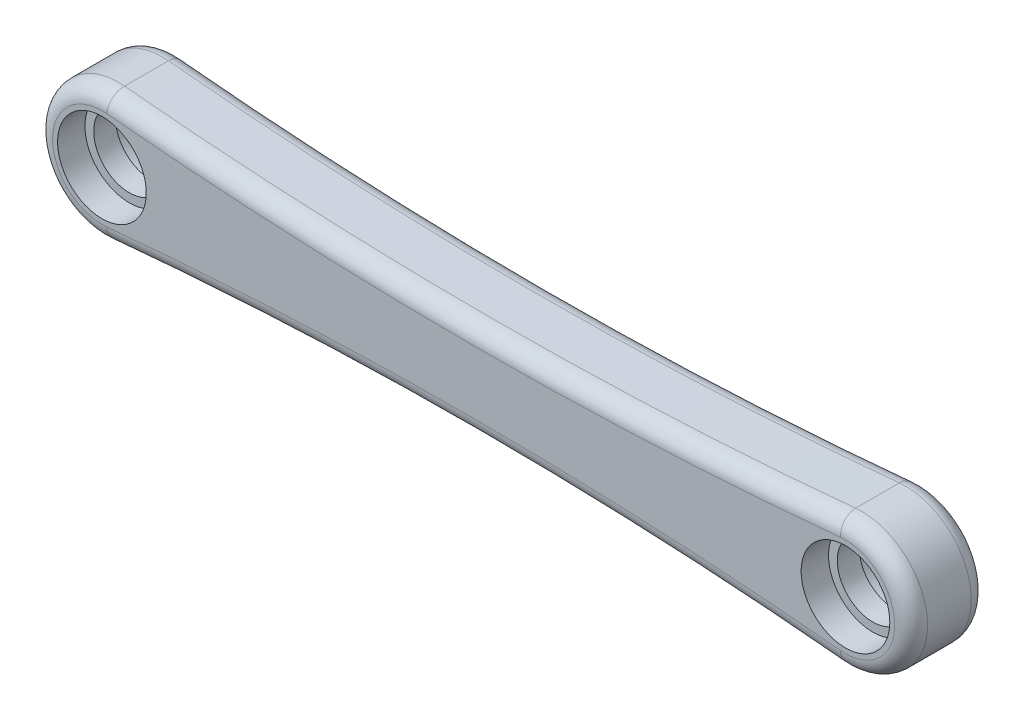
ISO-10303-21;
HEADER;
FILE_DESCRIPTION(('STEP AP214'),'2;1');
FILE_NAME('part.step','',(''),(''),'','','');
FILE_SCHEMA(('AUTOMOTIVE_DESIGN { 1 0 10303 214 1 1 1 1 }'));
ENDSEC;
DATA;
#1=APPLICATION_CONTEXT('core data for automotive mechanical design processes');
#2=APPLICATION_PROTOCOL_DEFINITION('international standard','automotive_design',2000,#1);
#3=PRODUCT_CONTEXT('',#1,'mechanical');
#4=PRODUCT('Part','Part','',(#3));
#5=PRODUCT_RELATED_PRODUCT_CATEGORY('part','',(#4));
#6=PRODUCT_DEFINITION_FORMATION('','',#4);
#7=PRODUCT_DEFINITION_CONTEXT('part definition',#1,'design');
#8=PRODUCT_DEFINITION('design','',#6,#7);
#9=PRODUCT_DEFINITION_SHAPE('','',#8);
#10=(LENGTH_UNIT() NAMED_UNIT(*) SI_UNIT(.MILLI.,.METRE.));
#11=(NAMED_UNIT(*) PLANE_ANGLE_UNIT() SI_UNIT($,.RADIAN.));
#12=(NAMED_UNIT(*) SI_UNIT($,.STERADIAN.) SOLID_ANGLE_UNIT());
#13=UNCERTAINTY_MEASURE_WITH_UNIT(LENGTH_MEASURE(1.E-05),#10,'distance_accuracy_value','');
#14=(GEOMETRIC_REPRESENTATION_CONTEXT(3) GLOBAL_UNCERTAINTY_ASSIGNED_CONTEXT((#13)) GLOBAL_UNIT_ASSIGNED_CONTEXT((#10,
#11,#12)) REPRESENTATION_CONTEXT('',''));
#15=CARTESIAN_POINT('',(0.,0.,0.));
#16=DIRECTION('',(0.,0.,1.));
#17=DIRECTION('',(1.,0.,0.));
#18=AXIS2_PLACEMENT_3D('',#15,#16,#17);
#19=CARTESIAN_POINT('',(0.,0.,0.));
#20=DIRECTION('',(0.,0.,1.));
#21=DIRECTION('',(1.,0.,0.));
#22=AXIS2_PLACEMENT_3D('',#19,#20,#21);
#23=PLANE('',#22);
#24=CARTESIAN_POINT('',(67.925,-708.752562164681,0.));
#25=DIRECTION('',(0.,0.,1.));
#26=DIRECTION('',(1.,0.,0.));
#27=AXIS2_PLACEMENT_3D('',#24,#25,#26);
#28=CIRCLE('',#27,703.);
#29=CARTESIAN_POINT('',(134.99139747191,-8.95895092623895,0.));
#30=VERTEX_POINT('',#29);
#31=CARTESIAN_POINT('',(0.85860252808988,-8.95895092623883,0.));
#32=VERTEX_POINT('',#31);
#33=EDGE_CURVE('E61',#30,#32,#28,.T.);
#34=ORIENTED_EDGE('',*,*,#33,.T.);
#35=CARTESIAN_POINT('',(0.,0.,0.));
#36=DIRECTION('',(0.,0.,1.));
#37=DIRECTION('',(1.,0.,0.));
#38=AXIS2_PLACEMENT_3D('',#35,#36,#37);
#39=CIRCLE('',#38,9.);
#40=CARTESIAN_POINT('',(0.858602528089873,8.95895092623883,0.));
#41=VERTEX_POINT('',#40);
#42=EDGE_CURVE('E163',#32,#41,#39,.F.);
#43=ORIENTED_EDGE('',*,*,#42,.T.);
#44=CARTESIAN_POINT('',(67.925,708.752562164681,0.));
#45=DIRECTION('',(0.,0.,1.));
#46=DIRECTION('',(1.,0.,0.));
#47=AXIS2_PLACEMENT_3D('',#44,#45,#46);
#48=CIRCLE('',#47,703.);
#49=CARTESIAN_POINT('',(134.99139747191,8.95895092623883,0.));
#50=VERTEX_POINT('',#49);
#51=EDGE_CURVE('E159',#41,#50,#48,.T.);
#52=ORIENTED_EDGE('',*,*,#51,.T.);
#53=CARTESIAN_POINT('',(135.85,0.,0.));
#54=DIRECTION('',(0.,0.,1.));
#55=DIRECTION('',(1.,0.,0.));
#56=AXIS2_PLACEMENT_3D('',#53,#54,#55);
#57=CIRCLE('',#56,9.);
#58=EDGE_CURVE('E66',#50,#30,#57,.F.);
#59=ORIENTED_EDGE('',*,*,#58,.T.);
#60=EDGE_LOOP('',(#34,#43,#52,#59));
#61=FACE_BOUND('',#60,.T.);
#62=CARTESIAN_POINT('',(0.,0.,0.));
#63=DIRECTION('',(0.,0.,1.));
#64=DIRECTION('',(1.,0.,0.));
#65=AXIS2_PLACEMENT_3D('',#62,#63,#64);
#66=CIRCLE('',#65,8.1);
#67=CARTESIAN_POINT('',(8.1,0.,0.));
#68=VERTEX_POINT('',#67);
#69=EDGE_CURVE('E136',#68,#68,#66,.T.);
#70=ORIENTED_EDGE('',*,*,#69,.T.);
#71=EDGE_LOOP('',(#70));
#72=FACE_BOUND('',#71,.T.);
#73=CARTESIAN_POINT('',(135.85,0.,0.));
#74=DIRECTION('',(0.,0.,1.));
#75=DIRECTION('',(1.,0.,0.));
#76=AXIS2_PLACEMENT_3D('',#73,#74,#75);
#77=CIRCLE('',#76,8.10000000000001);
#78=CARTESIAN_POINT('',(143.95,0.,0.));
#79=VERTEX_POINT('',#78);
#80=EDGE_CURVE('E139',#79,#79,#77,.T.);
#81=ORIENTED_EDGE('',*,*,#80,.T.);
#82=EDGE_LOOP('',(#81));
#83=FACE_BOUND('',#82,.T.);
#84=ADVANCED_FACE('F44',(#61,#72,#83),#23,.F.);
#85=CARTESIAN_POINT('',(0.,0.,14.));
#86=DIRECTION('',(0.,0.,-1.));
#87=DIRECTION('',(1.,0.,0.));
#88=AXIS2_PLACEMENT_3D('',#85,#86,#87);
#89=PLANE('',#88);
#90=CARTESIAN_POINT('',(67.925,708.752562164681,14.));
#91=DIRECTION('',(0.,0.,-1.));
#92=DIRECTION('',(-1.,0.,0.));
#93=AXIS2_PLACEMENT_3D('',#90,#91,#92);
#94=CIRCLE('',#93,703.);
#95=CARTESIAN_POINT('',(134.99139747191,8.95895092623884,14.));
#96=VERTEX_POINT('',#95);
#97=CARTESIAN_POINT('',(0.858602528089873,8.95895092623884,14.));
#98=VERTEX_POINT('',#97);
#99=EDGE_CURVE('E115',#96,#98,#94,.T.);
#100=ORIENTED_EDGE('',*,*,#99,.T.);
#101=CARTESIAN_POINT('',(0.,0.,14.));
#102=DIRECTION('',(0.,0.,-1.));
#103=DIRECTION('',(-1.,0.,0.));
#104=AXIS2_PLACEMENT_3D('',#101,#102,#103);
#105=CIRCLE('',#104,9.);
#106=CARTESIAN_POINT('',(0.85860252808988,-8.95895092623884,14.));
#107=VERTEX_POINT('',#106);
#108=EDGE_CURVE('E144',#98,#107,#105,.F.);
#109=ORIENTED_EDGE('',*,*,#108,.T.);
#110=CARTESIAN_POINT('',(67.925,-708.752562164681,14.));
#111=DIRECTION('',(0.,0.,-1.));
#112=DIRECTION('',(-1.,0.,0.));
#113=AXIS2_PLACEMENT_3D('',#110,#111,#112);
#114=CIRCLE('',#113,703.);
#115=CARTESIAN_POINT('',(134.99139747191,-8.95895092623895,14.));
#116=VERTEX_POINT('',#115);
#117=EDGE_CURVE('E118',#107,#116,#114,.T.);
#118=ORIENTED_EDGE('',*,*,#117,.T.);
#119=CARTESIAN_POINT('',(135.85,0.,14.));
#120=DIRECTION('',(0.,0.,-1.));
#121=DIRECTION('',(-1.,0.,0.));
#122=AXIS2_PLACEMENT_3D('',#119,#120,#121);
#123=CIRCLE('',#122,9.);
#124=EDGE_CURVE('E109',#116,#96,#123,.F.);
#125=ORIENTED_EDGE('',*,*,#124,.T.);
#126=EDGE_LOOP('',(#100,#109,#118,#125));
#127=FACE_BOUND('',#126,.T.);
#128=CARTESIAN_POINT('',(0.,0.,14.));
#129=DIRECTION('',(0.,0.,1.));
#130=DIRECTION('',(1.,0.,0.));
#131=AXIS2_PLACEMENT_3D('',#128,#129,#130);
#132=CIRCLE('',#131,8.1);
#133=CARTESIAN_POINT('',(8.1,0.,14.));
#134=VERTEX_POINT('',#133);
#135=EDGE_CURVE('E212',#134,#134,#132,.T.);
#136=ORIENTED_EDGE('',*,*,#135,.F.);
#137=EDGE_LOOP('',(#136));
#138=FACE_BOUND('',#137,.T.);
#139=CARTESIAN_POINT('',(135.85,0.,14.));
#140=DIRECTION('',(0.,0.,1.));
#141=DIRECTION('',(1.,0.,0.));
#142=AXIS2_PLACEMENT_3D('',#139,#140,#141);
#143=CIRCLE('',#142,8.10000000000001);
#144=CARTESIAN_POINT('',(143.95,0.,14.));
#145=VERTEX_POINT('',#144);
#146=EDGE_CURVE('E215',#145,#145,#143,.T.);
#147=ORIENTED_EDGE('',*,*,#146,.F.);
#148=EDGE_LOOP('',(#147));
#149=FACE_BOUND('',#148,.T.);
#150=ADVANCED_FACE('F111',(#127,#138,#149),#89,.F.);
#151=CARTESIAN_POINT('',(0.,0.,5.));
#152=DIRECTION('',(0.,0.,-1.));
#153=DIRECTION('',(-1.,0.,0.));
#154=AXIS2_PLACEMENT_3D('',#151,#152,#153);
#155=CYLINDRICAL_SURFACE('',#154,12.);
#156=DIRECTION('',(0.,0.,-1.));
#157=VECTOR('',#156,1.);
#158=CARTESIAN_POINT('',(1.14480337078651,-11.9452679016518,14.));
#159=LINE('',#158,#157);
#160=CARTESIAN_POINT('',(1.14480337078651,-11.9452679016518,11.));
#161=VERTEX_POINT('',#160);
#162=CARTESIAN_POINT('',(1.14480337078651,-11.9452679016518,3.));
#163=VERTEX_POINT('',#162);
#164=EDGE_CURVE('E236',#161,#163,#159,.T.);
#165=ORIENTED_EDGE('',*,*,#164,.F.);
#166=CARTESIAN_POINT('',(0.,0.,11.));
#167=DIRECTION('',(0.,0.,-1.));
#168=DIRECTION('',(-1.,0.,0.));
#169=AXIS2_PLACEMENT_3D('',#166,#167,#168);
#170=CIRCLE('',#169,12.);
#171=CARTESIAN_POINT('',(1.1448033707865,11.9452679016518,11.));
#172=VERTEX_POINT('',#171);
#173=EDGE_CURVE('E149',#161,#172,#170,.T.);
#174=ORIENTED_EDGE('',*,*,#173,.T.);
#175=DIRECTION('',(0.,0.,-1.));
#176=VECTOR('',#175,1.);
#177=CARTESIAN_POINT('',(1.1448033707865,11.9452679016518,14.));
#178=LINE('',#177,#176);
#179=CARTESIAN_POINT('',(1.1448033707865,11.9452679016518,3.));
#180=VERTEX_POINT('',#179);
#181=EDGE_CURVE('E230',#172,#180,#178,.T.);
#182=ORIENTED_EDGE('',*,*,#181,.T.);
#183=CARTESIAN_POINT('',(0.,0.,3.));
#184=DIRECTION('',(0.,0.,1.));
#185=DIRECTION('',(1.,0.,0.));
#186=AXIS2_PLACEMENT_3D('',#183,#184,#185);
#187=CIRCLE('',#186,12.);
#188=EDGE_CURVE('E146',#180,#163,#187,.T.);
#189=ORIENTED_EDGE('',*,*,#188,.T.);
#190=EDGE_LOOP('',(#165,#174,#182,#189));
#191=FACE_BOUND('',#190,.T.);
#192=ADVANCED_FACE('F243',(#191),#155,.T.);
#193=CARTESIAN_POINT('',(135.85,0.,5.));
#194=DIRECTION('',(0.,0.,-1.));
#195=DIRECTION('',(-1.,0.,0.));
#196=AXIS2_PLACEMENT_3D('',#193,#194,#195);
#197=CYLINDRICAL_SURFACE('',#196,12.);
#198=DIRECTION('',(0.,0.,-1.));
#199=VECTOR('',#198,1.);
#200=CARTESIAN_POINT('',(134.705196629213,11.9452679016518,14.));
#201=LINE('',#200,#199);
#202=CARTESIAN_POINT('',(134.705196629213,11.9452679016518,11.));
#203=VERTEX_POINT('',#202);
#204=CARTESIAN_POINT('',(134.705196629213,11.9452679016518,3.));
#205=VERTEX_POINT('',#204);
#206=EDGE_CURVE('E130',#203,#205,#201,.T.);
#207=ORIENTED_EDGE('',*,*,#206,.F.);
#208=CARTESIAN_POINT('',(135.85,0.,11.));
#209=DIRECTION('',(0.,0.,-1.));
#210=DIRECTION('',(-1.,0.,0.));
#211=AXIS2_PLACEMENT_3D('',#208,#209,#210);
#212=CIRCLE('',#211,12.);
#213=CARTESIAN_POINT('',(134.705196629213,-11.9452679016518,11.));
#214=VERTEX_POINT('',#213);
#215=EDGE_CURVE('E127',#203,#214,#212,.T.);
#216=ORIENTED_EDGE('',*,*,#215,.T.);
#217=DIRECTION('',(0.,0.,-1.));
#218=VECTOR('',#217,1.);
#219=CARTESIAN_POINT('',(134.705196629213,-11.9452679016518,14.));
#220=LINE('',#219,#218);
#221=CARTESIAN_POINT('',(134.705196629213,-11.9452679016518,3.));
#222=VERTEX_POINT('',#221);
#223=EDGE_CURVE('E233',#214,#222,#220,.T.);
#224=ORIENTED_EDGE('',*,*,#223,.T.);
#225=CARTESIAN_POINT('',(135.85,0.,3.));
#226=DIRECTION('',(0.,0.,1.));
#227=DIRECTION('',(1.,0.,0.));
#228=AXIS2_PLACEMENT_3D('',#225,#226,#227);
#229=CIRCLE('',#228,12.);
#230=EDGE_CURVE('E156',#222,#205,#229,.T.);
#231=ORIENTED_EDGE('',*,*,#230,.T.);
#232=EDGE_LOOP('',(#207,#216,#224,#231));
#233=FACE_BOUND('',#232,.T.);
#234=ADVANCED_FACE('F249',(#233),#197,.T.);
#235=CARTESIAN_POINT('',(0.,0.,5.));
#236=DIRECTION('',(0.,0.,-1.));
#237=DIRECTION('',(-1.,0.,0.));
#238=AXIS2_PLACEMENT_3D('',#235,#236,#237);
#239=CYLINDRICAL_SURFACE('',#238,8.1);
#240=CARTESIAN_POINT('',(0.,0.,5.));
#241=DIRECTION('',(0.,0.,1.));
#242=DIRECTION('',(1.,0.,0.));
#243=AXIS2_PLACEMENT_3D('',#240,#241,#242);
#244=CIRCLE('',#243,8.1);
#245=CARTESIAN_POINT('',(8.1,0.,5.));
#246=VERTEX_POINT('',#245);
#247=EDGE_CURVE('E199',#246,#246,#244,.T.);
#248=ORIENTED_EDGE('',*,*,#247,.T.);
#249=EDGE_LOOP('',(#248));
#250=FACE_BOUND('',#249,.T.);
#251=ORIENTED_EDGE('',*,*,#69,.F.);
#252=EDGE_LOOP('',(#251));
#253=FACE_BOUND('',#252,.T.);
#254=ADVANCED_FACE('F363',(#250,#253),#239,.F.);
#255=CARTESIAN_POINT('',(135.85,0.,5.));
#256=DIRECTION('',(0.,0.,-1.));
#257=DIRECTION('',(-1.,0.,0.));
#258=AXIS2_PLACEMENT_3D('',#255,#256,#257);
#259=CYLINDRICAL_SURFACE('',#258,8.10000000000001);
#260=CARTESIAN_POINT('',(135.85,0.,5.));
#261=DIRECTION('',(0.,0.,1.));
#262=DIRECTION('',(1.,0.,0.));
#263=AXIS2_PLACEMENT_3D('',#260,#261,#262);
#264=CIRCLE('',#263,8.10000000000001);
#265=CARTESIAN_POINT('',(143.95,0.,5.));
#266=VERTEX_POINT('',#265);
#267=EDGE_CURVE('E202',#266,#266,#264,.T.);
#268=ORIENTED_EDGE('',*,*,#267,.T.);
#269=EDGE_LOOP('',(#268));
#270=FACE_BOUND('',#269,.T.);
#271=ORIENTED_EDGE('',*,*,#80,.F.);
#272=EDGE_LOOP('',(#271));
#273=FACE_BOUND('',#272,.T.);
#274=ADVANCED_FACE('F475',(#270,#273),#259,.F.);
#275=CARTESIAN_POINT('',(0.,0.,5.));
#276=DIRECTION('',(0.,0.,1.));
#277=DIRECTION('',(1.,0.,0.));
#278=AXIS2_PLACEMENT_3D('',#275,#276,#277);
#279=PLANE('',#278);
#280=CARTESIAN_POINT('',(0.,0.,5.));
#281=DIRECTION('',(0.,0.,1.));
#282=DIRECTION('',(1.,0.,0.));
#283=AXIS2_PLACEMENT_3D('',#280,#281,#282);
#284=CIRCLE('',#283,6.5);
#285=CARTESIAN_POINT('',(6.5,0.,5.));
#286=VERTEX_POINT('',#285);
#287=EDGE_CURVE('E206',#286,#286,#284,.T.);
#288=ORIENTED_EDGE('',*,*,#287,.T.);
#289=EDGE_LOOP('',(#288));
#290=FACE_BOUND('',#289,.T.);
#291=ORIENTED_EDGE('',*,*,#247,.F.);
#292=EDGE_LOOP('',(#291));
#293=FACE_BOUND('',#292,.T.);
#294=ADVANCED_FACE('F465',(#290,#293),#279,.F.);
#295=CARTESIAN_POINT('',(135.85,0.,5.));
#296=DIRECTION('',(0.,0.,1.));
#297=DIRECTION('',(1.,0.,0.));
#298=AXIS2_PLACEMENT_3D('',#295,#296,#297);
#299=CIRCLE('',#298,6.50000000000001);
#300=CARTESIAN_POINT('',(142.35,0.,5.));
#301=VERTEX_POINT('',#300);
#302=EDGE_CURVE('E209',#301,#301,#299,.T.);
#303=ORIENTED_EDGE('',*,*,#302,.T.);
#304=EDGE_LOOP('',(#303));
#305=FACE_BOUND('',#304,.T.);
#306=ORIENTED_EDGE('',*,*,#267,.F.);
#307=EDGE_LOOP('',(#306));
#308=FACE_BOUND('',#307,.T.);
#309=ADVANCED_FACE('F452',(#305,#308),#279,.F.);
#310=CARTESIAN_POINT('',(0.,0.,7.));
#311=DIRECTION('',(0.,0.,-1.));
#312=DIRECTION('',(-1.,0.,0.));
#313=AXIS2_PLACEMENT_3D('',#310,#311,#312);
#314=CYLINDRICAL_SURFACE('',#313,6.5);
#315=ORIENTED_EDGE('',*,*,#287,.F.);
#316=EDGE_LOOP('',(#315));
#317=FACE_BOUND('',#316,.T.);
#318=CARTESIAN_POINT('',(0.,0.,9.));
#319=DIRECTION('',(0.,0.,1.));
#320=DIRECTION('',(1.,0.,0.));
#321=AXIS2_PLACEMENT_3D('',#318,#319,#320);
#322=CIRCLE('',#321,6.5);
#323=CARTESIAN_POINT('',(6.5,0.,9.));
#324=VERTEX_POINT('',#323);
#325=EDGE_CURVE('E224',#324,#324,#322,.T.);
#326=ORIENTED_EDGE('',*,*,#325,.T.);
#327=EDGE_LOOP('',(#326));
#328=FACE_BOUND('',#327,.T.);
#329=ADVANCED_FACE('F441',(#317,#328),#314,.F.);
#330=CARTESIAN_POINT('',(135.85,0.,7.));
#331=DIRECTION('',(0.,0.,-1.));
#332=DIRECTION('',(-1.,0.,0.));
#333=AXIS2_PLACEMENT_3D('',#330,#331,#332);
#334=CYLINDRICAL_SURFACE('',#333,6.50000000000001);
#335=ORIENTED_EDGE('',*,*,#302,.F.);
#336=EDGE_LOOP('',(#335));
#337=FACE_BOUND('',#336,.T.);
#338=CARTESIAN_POINT('',(135.85,0.,9.));
#339=DIRECTION('',(0.,0.,1.));
#340=DIRECTION('',(1.,0.,0.));
#341=AXIS2_PLACEMENT_3D('',#338,#339,#340);
#342=CIRCLE('',#341,6.50000000000001);
#343=CARTESIAN_POINT('',(142.35,0.,9.));
#344=VERTEX_POINT('',#343);
#345=EDGE_CURVE('E227',#344,#344,#342,.T.);
#346=ORIENTED_EDGE('',*,*,#345,.T.);
#347=EDGE_LOOP('',(#346));
#348=FACE_BOUND('',#347,.T.);
#349=ADVANCED_FACE('F431',(#337,#348),#334,.F.);
#350=CARTESIAN_POINT('',(0.,0.,9.));
#351=DIRECTION('',(0.,0.,1.));
#352=DIRECTION('',(-1.,0.,0.));
#353=AXIS2_PLACEMENT_3D('',#350,#351,#352);
#354=CYLINDRICAL_SURFACE('',#353,8.1);
#355=CARTESIAN_POINT('',(0.,0.,9.));
#356=DIRECTION('',(0.,0.,1.));
#357=DIRECTION('',(1.,0.,0.));
#358=AXIS2_PLACEMENT_3D('',#355,#356,#357);
#359=CIRCLE('',#358,8.1);
#360=CARTESIAN_POINT('',(8.1,0.,9.));
#361=VERTEX_POINT('',#360);
#362=EDGE_CURVE('E216',#361,#361,#359,.T.);
#363=ORIENTED_EDGE('',*,*,#362,.F.);
#364=EDGE_LOOP('',(#363));
#365=FACE_BOUND('',#364,.T.);
#366=ORIENTED_EDGE('',*,*,#135,.T.);
#367=EDGE_LOOP('',(#366));
#368=FACE_BOUND('',#367,.T.);
#369=ADVANCED_FACE('F420',(#365,#368),#354,.F.);
#370=CARTESIAN_POINT('',(135.85,0.,9.));
#371=DIRECTION('',(0.,0.,1.));
#372=DIRECTION('',(-1.,0.,0.));
#373=AXIS2_PLACEMENT_3D('',#370,#371,#372);
#374=CYLINDRICAL_SURFACE('',#373,8.10000000000001);
#375=CARTESIAN_POINT('',(135.85,0.,9.));
#376=DIRECTION('',(0.,0.,1.));
#377=DIRECTION('',(1.,0.,0.));
#378=AXIS2_PLACEMENT_3D('',#375,#376,#377);
#379=CIRCLE('',#378,8.10000000000001);
#380=CARTESIAN_POINT('',(143.95,0.,9.));
#381=VERTEX_POINT('',#380);
#382=EDGE_CURVE('E219',#381,#381,#379,.T.);
#383=ORIENTED_EDGE('',*,*,#382,.F.);
#384=EDGE_LOOP('',(#383));
#385=FACE_BOUND('',#384,.T.);
#386=ORIENTED_EDGE('',*,*,#146,.T.);
#387=EDGE_LOOP('',(#386));
#388=FACE_BOUND('',#387,.T.);
#389=ADVANCED_FACE('F410',(#385,#388),#374,.F.);
#390=CARTESIAN_POINT('',(0.,0.,9.));
#391=DIRECTION('',(0.,0.,-1.));
#392=DIRECTION('',(1.,0.,0.));
#393=AXIS2_PLACEMENT_3D('',#390,#391,#392);
#394=PLANE('',#393);
#395=ORIENTED_EDGE('',*,*,#325,.F.);
#396=EDGE_LOOP('',(#395));
#397=FACE_BOUND('',#396,.T.);
#398=ORIENTED_EDGE('',*,*,#362,.T.);
#399=EDGE_LOOP('',(#398));
#400=FACE_BOUND('',#399,.T.);
#401=ADVANCED_FACE('F399',(#397,#400),#394,.F.);
#402=ORIENTED_EDGE('',*,*,#345,.F.);
#403=EDGE_LOOP('',(#402));
#404=FACE_BOUND('',#403,.T.);
#405=ORIENTED_EDGE('',*,*,#382,.T.);
#406=EDGE_LOOP('',(#405));
#407=FACE_BOUND('',#406,.T.);
#408=ADVANCED_FACE('F352',(#404,#407),#394,.F.);
#409=CARTESIAN_POINT('',(67.925,-708.752562164681,14.));
#410=DIRECTION('',(0.,0.,-1.));
#411=DIRECTION('',(-1.,0.,0.));
#412=AXIS2_PLACEMENT_3D('',#409,#410,#411);
#413=CYLINDRICAL_SURFACE('',#412,700.);
#414=ORIENTED_EDGE('',*,*,#223,.F.);
#415=CARTESIAN_POINT('',(67.925,-708.752562164681,11.));
#416=DIRECTION('',(0.,0.,-1.));
#417=DIRECTION('',(-1.,0.,0.));
#418=AXIS2_PLACEMENT_3D('',#415,#416,#417);
#419=CIRCLE('',#418,700.);
#420=EDGE_CURVE('E154',#214,#161,#419,.F.);
#421=ORIENTED_EDGE('',*,*,#420,.T.);
#422=ORIENTED_EDGE('',*,*,#164,.T.);
#423=CARTESIAN_POINT('',(67.925,-708.752562164681,3.));
#424=DIRECTION('',(0.,0.,1.));
#425=DIRECTION('',(1.,0.,0.));
#426=AXIS2_PLACEMENT_3D('',#423,#424,#425);
#427=CIRCLE('',#426,700.);
#428=EDGE_CURVE('E152',#163,#222,#427,.F.);
#429=ORIENTED_EDGE('',*,*,#428,.T.);
#430=EDGE_LOOP('',(#414,#421,#422,#429));
#431=FACE_BOUND('',#430,.T.);
#432=ADVANCED_FACE('F252',(#431),#413,.F.);
#433=CARTESIAN_POINT('',(67.925,708.752562164681,14.));
#434=DIRECTION('',(0.,0.,-1.));
#435=DIRECTION('',(-1.,0.,0.));
#436=AXIS2_PLACEMENT_3D('',#433,#434,#435);
#437=CYLINDRICAL_SURFACE('',#436,700.);
#438=ORIENTED_EDGE('',*,*,#181,.F.);
#439=CARTESIAN_POINT('',(67.925,708.752562164681,11.));
#440=DIRECTION('',(0.,0.,-1.));
#441=DIRECTION('',(-1.,0.,0.));
#442=AXIS2_PLACEMENT_3D('',#439,#440,#441);
#443=CIRCLE('',#442,700.);
#444=EDGE_CURVE('E12',#172,#203,#443,.F.);
#445=ORIENTED_EDGE('',*,*,#444,.T.);
#446=ORIENTED_EDGE('',*,*,#206,.T.);
#447=CARTESIAN_POINT('',(67.925,708.752562164681,3.));
#448=DIRECTION('',(0.,0.,1.));
#449=DIRECTION('',(1.,0.,0.));
#450=AXIS2_PLACEMENT_3D('',#447,#448,#449);
#451=CIRCLE('',#450,700.);
#452=EDGE_CURVE('E53',#205,#180,#451,.F.);
#453=ORIENTED_EDGE('',*,*,#452,.T.);
#454=EDGE_LOOP('',(#438,#445,#446,#453));
#455=FACE_BOUND('',#454,.T.);
#456=ADVANCED_FACE('F246',(#455),#437,.F.);
#457=CARTESIAN_POINT('',(135.85,0.,11.));
#458=DIRECTION('',(0.,0.,-1.));
#459=DIRECTION('',(-1.,0.,0.));
#460=AXIS2_PLACEMENT_3D('',#457,#458,#459);
#461=TOROIDAL_SURFACE('',#460,9.,3.);
#462=CARTESIAN_POINT('',(134.99139747191,-8.95895092623894,11.));
#463=DIRECTION('',(-0.995438991804328,0.0954002808988737,0.));
#464=DIRECTION('',(-0.0954002808988737,-0.995438991804328,0.));
#465=AXIS2_PLACEMENT_3D('',#462,#463,#464);
#466=CIRCLE('',#465,3.);
#467=EDGE_CURVE('E131',#214,#116,#466,.T.);
#468=ORIENTED_EDGE('',*,*,#467,.F.);
#469=ORIENTED_EDGE('',*,*,#215,.F.);
#470=CARTESIAN_POINT('',(134.99139747191,8.95895092623895,11.));
#471=DIRECTION('',(-0.995438991804328,-0.0954002808988738,0.));
#472=DIRECTION('',(0.0954002808988738,-0.995438991804328,0.));
#473=AXIS2_PLACEMENT_3D('',#470,#471,#472);
#474=CIRCLE('',#473,3.);
#475=EDGE_CURVE('E125',#96,#203,#474,.T.);
#476=ORIENTED_EDGE('',*,*,#475,.F.);
#477=ORIENTED_EDGE('',*,*,#124,.F.);
#478=EDGE_LOOP('',(#468,#469,#476,#477));
#479=FACE_BOUND('',#478,.T.);
#480=ADVANCED_FACE('F126',(#479),#461,.T.);
#481=CARTESIAN_POINT('',(67.925,708.752562164681,11.));
#482=DIRECTION('',(0.,0.,-1.));
#483=DIRECTION('',(-1.,0.,0.));
#484=AXIS2_PLACEMENT_3D('',#481,#482,#483);
#485=TOROIDAL_SURFACE('',#484,703.,3.);
#486=ORIENTED_EDGE('',*,*,#475,.T.);
#487=ORIENTED_EDGE('',*,*,#444,.F.);
#488=CARTESIAN_POINT('',(0.858602528089873,8.95895092623884,11.));
#489=DIRECTION('',(-0.995438991804327,0.095400280898876,0.));
#490=DIRECTION('',(-0.095400280898876,-0.995438991804327,0.));
#491=AXIS2_PLACEMENT_3D('',#488,#489,#490);
#492=CIRCLE('',#491,3.);
#493=EDGE_CURVE('E134',#98,#172,#492,.T.);
#494=ORIENTED_EDGE('',*,*,#493,.F.);
#495=ORIENTED_EDGE('',*,*,#99,.F.);
#496=EDGE_LOOP('',(#486,#487,#494,#495));
#497=FACE_BOUND('',#496,.T.);
#498=ADVANCED_FACE('F133',(#497),#485,.T.);
#499=CARTESIAN_POINT('',(67.925,-708.752562164681,11.));
#500=DIRECTION('',(0.,0.,-1.));
#501=DIRECTION('',(-1.,0.,0.));
#502=AXIS2_PLACEMENT_3D('',#499,#500,#501);
#503=TOROIDAL_SURFACE('',#502,703.,3.);
#504=ORIENTED_EDGE('',*,*,#467,.T.);
#505=ORIENTED_EDGE('',*,*,#117,.F.);
#506=CARTESIAN_POINT('',(0.85860252808988,-8.95895092623883,11.));
#507=DIRECTION('',(-0.995438991804327,-0.0954002808988764,0.));
#508=DIRECTION('',(0.0954002808988764,-0.995438991804327,0.));
#509=AXIS2_PLACEMENT_3D('',#506,#507,#508);
#510=CIRCLE('',#509,3.);
#511=EDGE_CURVE('E166',#161,#107,#510,.T.);
#512=ORIENTED_EDGE('',*,*,#511,.F.);
#513=ORIENTED_EDGE('',*,*,#420,.F.);
#514=EDGE_LOOP('',(#504,#505,#512,#513));
#515=FACE_BOUND('',#514,.T.);
#516=ADVANCED_FACE('F256',(#515),#503,.T.);
#517=CARTESIAN_POINT('',(0.,0.,11.));
#518=DIRECTION('',(0.,0.,-1.));
#519=DIRECTION('',(-1.,0.,0.));
#520=AXIS2_PLACEMENT_3D('',#517,#518,#519);
#521=TOROIDAL_SURFACE('',#520,9.,3.);
#522=ORIENTED_EDGE('',*,*,#493,.T.);
#523=ORIENTED_EDGE('',*,*,#173,.F.);
#524=ORIENTED_EDGE('',*,*,#511,.T.);
#525=ORIENTED_EDGE('',*,*,#108,.F.);
#526=EDGE_LOOP('',(#522,#523,#524,#525));
#527=FACE_BOUND('',#526,.T.);
#528=ADVANCED_FACE('F258',(#527),#521,.T.);
#529=CARTESIAN_POINT('',(135.85,0.,3.));
#530=DIRECTION('',(0.,0.,1.));
#531=DIRECTION('',(1.,0.,0.));
#532=AXIS2_PLACEMENT_3D('',#529,#530,#531);
#533=TOROIDAL_SURFACE('',#532,9.,3.);
#534=CARTESIAN_POINT('',(134.99139747191,-8.95895092623895,3.));
#535=DIRECTION('',(-0.995438991804327,0.0954002808988738,0.));
#536=DIRECTION('',(-0.0954002808988738,-0.995438991804328,0.));
#537=AXIS2_PLACEMENT_3D('',#534,#535,#536);
#538=CIRCLE('',#537,3.);
#539=EDGE_CURVE('E173',#30,#222,#538,.T.);
#540=ORIENTED_EDGE('',*,*,#539,.F.);
#541=ORIENTED_EDGE('',*,*,#58,.F.);
#542=CARTESIAN_POINT('',(134.99139747191,8.95895092623894,3.));
#543=DIRECTION('',(-0.995438991804327,-0.0954002808988737,0.));
#544=DIRECTION('',(0.0954002808988737,-0.995438991804327,0.));
#545=AXIS2_PLACEMENT_3D('',#542,#543,#544);
#546=CIRCLE('',#545,3.);
#547=EDGE_CURVE('E48',#205,#50,#546,.T.);
#548=ORIENTED_EDGE('',*,*,#547,.F.);
#549=ORIENTED_EDGE('',*,*,#230,.F.);
#550=EDGE_LOOP('',(#540,#541,#548,#549));
#551=FACE_BOUND('',#550,.T.);
#552=ADVANCED_FACE('F46',(#551),#533,.T.);
#553=CARTESIAN_POINT('',(67.925,708.752562164681,3.));
#554=DIRECTION('',(0.,0.,1.));
#555=DIRECTION('',(1.,0.,0.));
#556=AXIS2_PLACEMENT_3D('',#553,#554,#555);
#557=TOROIDAL_SURFACE('',#556,703.,3.);
#558=ORIENTED_EDGE('',*,*,#547,.T.);
#559=ORIENTED_EDGE('',*,*,#51,.F.);
#560=CARTESIAN_POINT('',(0.858602528089872,8.95895092623883,3.));
#561=DIRECTION('',(-0.995438991804327,0.0954002808988764,0.));
#562=DIRECTION('',(-0.0954002808988764,-0.995438991804327,0.));
#563=AXIS2_PLACEMENT_3D('',#560,#561,#562);
#564=CIRCLE('',#563,3.);
#565=EDGE_CURVE('E172',#180,#41,#564,.T.);
#566=ORIENTED_EDGE('',*,*,#565,.F.);
#567=ORIENTED_EDGE('',*,*,#452,.F.);
#568=EDGE_LOOP('',(#558,#559,#566,#567));
#569=FACE_BOUND('',#568,.T.);
#570=ADVANCED_FACE('F182',(#569),#557,.T.);
#571=CARTESIAN_POINT('',(67.925,-708.752562164681,3.));
#572=DIRECTION('',(0.,0.,1.));
#573=DIRECTION('',(1.,0.,0.));
#574=AXIS2_PLACEMENT_3D('',#571,#572,#573);
#575=TOROIDAL_SURFACE('',#574,703.,3.);
#576=ORIENTED_EDGE('',*,*,#539,.T.);
#577=ORIENTED_EDGE('',*,*,#428,.F.);
#578=CARTESIAN_POINT('',(0.85860252808988,-8.95895092623883,3.));
#579=DIRECTION('',(-0.995438991804327,-0.0954002808988767,0.));
#580=DIRECTION('',(0.0954002808988767,-0.995438991804327,0.));
#581=AXIS2_PLACEMENT_3D('',#578,#579,#580);
#582=CIRCLE('',#581,3.);
#583=EDGE_CURVE('E170',#32,#163,#582,.T.);
#584=ORIENTED_EDGE('',*,*,#583,.F.);
#585=ORIENTED_EDGE('',*,*,#33,.F.);
#586=EDGE_LOOP('',(#576,#577,#584,#585));
#587=FACE_BOUND('',#586,.T.);
#588=ADVANCED_FACE('F187',(#587),#575,.T.);
#589=CARTESIAN_POINT('',(0.,0.,3.));
#590=DIRECTION('',(0.,0.,1.));
#591=DIRECTION('',(1.,0.,0.));
#592=AXIS2_PLACEMENT_3D('',#589,#590,#591);
#593=TOROIDAL_SURFACE('',#592,9.,3.);
#594=ORIENTED_EDGE('',*,*,#565,.T.);
#595=ORIENTED_EDGE('',*,*,#42,.F.);
#596=ORIENTED_EDGE('',*,*,#583,.T.);
#597=ORIENTED_EDGE('',*,*,#188,.F.);
#598=EDGE_LOOP('',(#594,#595,#596,#597));
#599=FACE_BOUND('',#598,.T.);
#600=ADVANCED_FACE('F190',(#599),#593,.T.);
#601=CLOSED_SHELL('',(#84,#150,#192,#234,#254,#274,#294,#309,#329,#349,#369,#389,#401,#408,#432,
#456,#480,#498,#516,#528,#552,#570,#588,#600));
#602=MANIFOLD_SOLID_BREP('B2',#601);
#603=ADVANCED_BREP_SHAPE_REPRESENTATION('',(#18,#602),#14);
#604=SHAPE_DEFINITION_REPRESENTATION(#9,#603);
ENDSEC;
END-ISO-10303-21;
